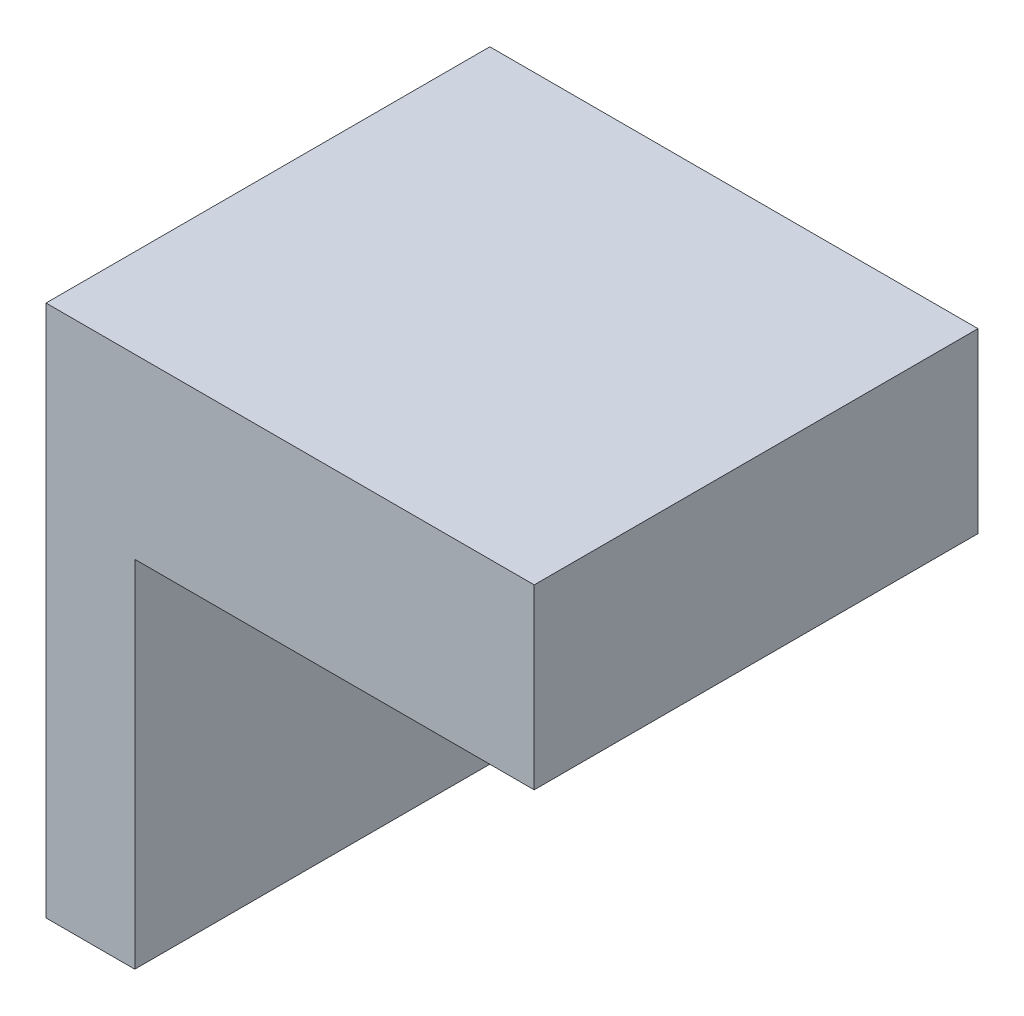
ISO-10303-21;
HEADER;
FILE_DESCRIPTION(('STEP AP214'),'2;1');
FILE_NAME('part.step','',(''),(''),'','','');
FILE_SCHEMA(('AUTOMOTIVE_DESIGN { 1 0 10303 214 1 1 1 1 }'));
ENDSEC;
DATA;
#1=APPLICATION_CONTEXT('core data for automotive mechanical design processes');
#2=APPLICATION_PROTOCOL_DEFINITION('international standard','automotive_design',2000,#1);
#3=PRODUCT_CONTEXT('',#1,'mechanical');
#4=PRODUCT('Part','Part','',(#3));
#5=PRODUCT_RELATED_PRODUCT_CATEGORY('part','',(#4));
#6=PRODUCT_DEFINITION_FORMATION('','',#4);
#7=PRODUCT_DEFINITION_CONTEXT('part definition',#1,'design');
#8=PRODUCT_DEFINITION('design','',#6,#7);
#9=PRODUCT_DEFINITION_SHAPE('','',#8);
#10=(LENGTH_UNIT() NAMED_UNIT(*) SI_UNIT(.MILLI.,.METRE.));
#11=(NAMED_UNIT(*) PLANE_ANGLE_UNIT() SI_UNIT($,.RADIAN.));
#12=(NAMED_UNIT(*) SI_UNIT($,.STERADIAN.) SOLID_ANGLE_UNIT());
#13=UNCERTAINTY_MEASURE_WITH_UNIT(LENGTH_MEASURE(1.E-05),#10,'distance_accuracy_value','');
#14=(GEOMETRIC_REPRESENTATION_CONTEXT(3) GLOBAL_UNCERTAINTY_ASSIGNED_CONTEXT((#13)) GLOBAL_UNIT_ASSIGNED_CONTEXT((#10,
#11,#12)) REPRESENTATION_CONTEXT('',''));
#15=CARTESIAN_POINT('',(0.,0.,0.));
#16=DIRECTION('',(0.,0.,1.));
#17=DIRECTION('',(1.,0.,0.));
#18=AXIS2_PLACEMENT_3D('',#15,#16,#17);
#19=CARTESIAN_POINT('',(-42.3130003902125,-15.1462692619627,50.));
#20=DIRECTION('',(1.,0.,0.));
#21=DIRECTION('',(0.,0.,-1.));
#22=AXIS2_PLACEMENT_3D('',#19,#20,#21);
#23=PLANE('',#22);
#24=CARTESIAN_POINT('',(-42.3130003902125,-55.1462692619627,25.));
#25=DIRECTION('',(1.,0.,0.));
#26=DIRECTION('',(0.,0.,-1.));
#27=AXIS2_PLACEMENT_3D('',#24,#25,#26);
#28=CIRCLE('',#27,2.49999999999999);
#29=CARTESIAN_POINT('',(-42.3130003902125,-55.1462692619627,22.5));
#30=VERTEX_POINT('',#29);
#31=EDGE_CURVE('E121',#30,#30,#28,.T.);
#32=ORIENTED_EDGE('',*,*,#31,.T.);
#33=EDGE_LOOP('',(#32));
#34=FACE_BOUND('',#33,.T.);
#35=DIRECTION('',(0.,-1.,0.));
#36=VECTOR('',#35,1.);
#37=CARTESIAN_POINT('',(-42.3130003902125,-15.1462692619627,0.));
#38=LINE('',#37,#36);
#39=CARTESIAN_POINT('',(-42.3130003902125,-15.1462692619627,0.));
#40=VERTEX_POINT('',#39);
#41=CARTESIAN_POINT('',(-42.3130003902125,-75.1462692619627,0.));
#42=VERTEX_POINT('',#41);
#43=EDGE_CURVE('E117',#40,#42,#38,.T.);
#44=ORIENTED_EDGE('',*,*,#43,.T.);
#45=DIRECTION('',(0.,0.,-1.));
#46=VECTOR('',#45,1.);
#47=CARTESIAN_POINT('',(-42.3130003902125,-75.1462692619627,50.));
#48=LINE('',#47,#46);
#49=CARTESIAN_POINT('',(-42.3130003902125,-75.1462692619627,50.));
#50=VERTEX_POINT('',#49);
#51=EDGE_CURVE('E11',#50,#42,#48,.T.);
#52=ORIENTED_EDGE('',*,*,#51,.F.);
#53=DIRECTION('',(0.,-1.,0.));
#54=VECTOR('',#53,1.);
#55=CARTESIAN_POINT('',(-42.3130003902125,-15.1462692619627,50.));
#56=LINE('',#55,#54);
#57=CARTESIAN_POINT('',(-42.3130003902125,-15.1462692619627,50.));
#58=VERTEX_POINT('',#57);
#59=EDGE_CURVE('E128',#58,#50,#56,.T.);
#60=ORIENTED_EDGE('',*,*,#59,.F.);
#61=DIRECTION('',(0.,0.,-1.));
#62=VECTOR('',#61,1.);
#63=CARTESIAN_POINT('',(-42.3130003902125,-15.1462692619627,50.));
#64=LINE('',#63,#62);
#65=EDGE_CURVE('E113',#58,#40,#64,.T.);
#66=ORIENTED_EDGE('',*,*,#65,.T.);
#67=EDGE_LOOP('',(#44,#52,#60,#66));
#68=FACE_BOUND('',#67,.T.);
#69=ADVANCED_FACE('F33',(#34,#68),#23,.F.);
#70=CARTESIAN_POINT('',(-42.3130003902125,-75.1462692619627,50.));
#71=DIRECTION('',(0.,1.,0.));
#72=DIRECTION('',(0.,0.,1.));
#73=AXIS2_PLACEMENT_3D('',#70,#71,#72);
#74=PLANE('',#73);
#75=DIRECTION('',(1.,0.,0.));
#76=VECTOR('',#75,1.);
#77=CARTESIAN_POINT('',(-42.3130003902125,-75.1462692619627,0.));
#78=LINE('',#77,#76);
#79=CARTESIAN_POINT('',(-32.3130003902125,-75.1462692619627,0.));
#80=VERTEX_POINT('',#79);
#81=EDGE_CURVE('E120',#42,#80,#78,.T.);
#82=ORIENTED_EDGE('',*,*,#81,.T.);
#83=DIRECTION('',(0.,0.,-1.));
#84=VECTOR('',#83,1.);
#85=CARTESIAN_POINT('',(-32.3130003902125,-75.1462692619627,50.));
#86=LINE('',#85,#84);
#87=CARTESIAN_POINT('',(-32.3130003902125,-75.1462692619627,50.));
#88=VERTEX_POINT('',#87);
#89=EDGE_CURVE('E41',#88,#80,#86,.T.);
#90=ORIENTED_EDGE('',*,*,#89,.F.);
#91=DIRECTION('',(1.,0.,0.));
#92=VECTOR('',#91,1.);
#93=CARTESIAN_POINT('',(-42.3130003902125,-75.1462692619627,50.));
#94=LINE('',#93,#92);
#95=EDGE_CURVE('E86',#50,#88,#94,.T.);
#96=ORIENTED_EDGE('',*,*,#95,.F.);
#97=ORIENTED_EDGE('',*,*,#51,.T.);
#98=EDGE_LOOP('',(#82,#90,#96,#97));
#99=FACE_BOUND('',#98,.T.);
#100=ADVANCED_FACE('F152',(#99),#74,.F.);
#101=CARTESIAN_POINT('',(-32.3130003902125,-75.1462692619627,50.));
#102=DIRECTION('',(-1.,0.,0.));
#103=DIRECTION('',(0.,0.,1.));
#104=AXIS2_PLACEMENT_3D('',#101,#102,#103);
#105=PLANE('',#104);
#106=CARTESIAN_POINT('',(-32.3130003902125,-55.1462692619627,25.));
#107=DIRECTION('',(1.,0.,0.));
#108=DIRECTION('',(0.,0.,-1.));
#109=AXIS2_PLACEMENT_3D('',#106,#107,#108);
#110=CIRCLE('',#109,2.49999999999999);
#111=CARTESIAN_POINT('',(-32.3130003902125,-55.1462692619627,22.5));
#112=VERTEX_POINT('',#111);
#113=EDGE_CURVE('E160',#112,#112,#110,.T.);
#114=ORIENTED_EDGE('',*,*,#113,.F.);
#115=EDGE_LOOP('',(#114));
#116=FACE_BOUND('',#115,.T.);
#117=DIRECTION('',(0.,1.,0.));
#118=VECTOR('',#117,1.);
#119=CARTESIAN_POINT('',(-32.3130003902125,-75.1462692619627,0.));
#120=LINE('',#119,#118);
#121=CARTESIAN_POINT('',(-32.3130003902125,-35.1462692619627,0.));
#122=VERTEX_POINT('',#121);
#123=EDGE_CURVE('E123',#80,#122,#120,.T.);
#124=ORIENTED_EDGE('',*,*,#123,.T.);
#125=DIRECTION('',(0.,0.,-1.));
#126=VECTOR('',#125,1.);
#127=CARTESIAN_POINT('',(-32.3130003902125,-35.1462692619627,50.));
#128=LINE('',#127,#126);
#129=CARTESIAN_POINT('',(-32.3130003902125,-35.1462692619627,50.));
#130=VERTEX_POINT('',#129);
#131=EDGE_CURVE('E108',#130,#122,#128,.T.);
#132=ORIENTED_EDGE('',*,*,#131,.F.);
#133=DIRECTION('',(0.,1.,0.));
#134=VECTOR('',#133,1.);
#135=CARTESIAN_POINT('',(-32.3130003902125,-75.1462692619627,50.));
#136=LINE('',#135,#134);
#137=EDGE_CURVE('E99',#88,#130,#136,.T.);
#138=ORIENTED_EDGE('',*,*,#137,.F.);
#139=ORIENTED_EDGE('',*,*,#89,.T.);
#140=EDGE_LOOP('',(#124,#132,#138,#139));
#141=FACE_BOUND('',#140,.T.);
#142=ADVANCED_FACE('F134',(#116,#141),#105,.F.);
#143=CARTESIAN_POINT('',(-32.3130003902125,-35.1462692619627,50.));
#144=DIRECTION('',(0.,1.,0.));
#145=DIRECTION('',(0.,0.,1.));
#146=AXIS2_PLACEMENT_3D('',#143,#144,#145);
#147=PLANE('',#146);
#148=DIRECTION('',(1.,0.,0.));
#149=VECTOR('',#148,1.);
#150=CARTESIAN_POINT('',(-32.3130003902125,-35.1462692619627,0.));
#151=LINE('',#150,#149);
#152=CARTESIAN_POINT('',(12.6869996097875,-35.1462692619627,0.));
#153=VERTEX_POINT('',#152);
#154=EDGE_CURVE('E107',#122,#153,#151,.T.);
#155=ORIENTED_EDGE('',*,*,#154,.T.);
#156=DIRECTION('',(0.,0.,-1.));
#157=VECTOR('',#156,1.);
#158=CARTESIAN_POINT('',(12.6869996097875,-35.1462692619627,50.));
#159=LINE('',#158,#157);
#160=CARTESIAN_POINT('',(12.6869996097875,-35.1462692619627,50.));
#161=VERTEX_POINT('',#160);
#162=EDGE_CURVE('E104',#161,#153,#159,.T.);
#163=ORIENTED_EDGE('',*,*,#162,.F.);
#164=DIRECTION('',(1.,0.,0.));
#165=VECTOR('',#164,1.);
#166=CARTESIAN_POINT('',(-32.3130003902125,-35.1462692619627,50.));
#167=LINE('',#166,#165);
#168=EDGE_CURVE('E93',#130,#161,#167,.T.);
#169=ORIENTED_EDGE('',*,*,#168,.F.);
#170=ORIENTED_EDGE('',*,*,#131,.T.);
#171=EDGE_LOOP('',(#155,#163,#169,#170));
#172=FACE_BOUND('',#171,.T.);
#173=ADVANCED_FACE('F105',(#172),#147,.F.);
#174=CARTESIAN_POINT('',(12.6869996097875,-35.1462692619627,50.));
#175=DIRECTION('',(-1.,0.,0.));
#176=DIRECTION('',(0.,0.,1.));
#177=AXIS2_PLACEMENT_3D('',#174,#175,#176);
#178=PLANE('',#177);
#179=DIRECTION('',(0.,1.,0.));
#180=VECTOR('',#179,1.);
#181=CARTESIAN_POINT('',(12.6869996097875,-35.1462692619627,0.));
#182=LINE('',#181,#180);
#183=CARTESIAN_POINT('',(12.6869996097875,-15.1462692619627,0.));
#184=VERTEX_POINT('',#183);
#185=EDGE_CURVE('E72',#153,#184,#182,.T.);
#186=ORIENTED_EDGE('',*,*,#185,.T.);
#187=DIRECTION('',(0.,0.,-1.));
#188=VECTOR('',#187,1.);
#189=CARTESIAN_POINT('',(12.6869996097875,-15.1462692619627,50.));
#190=LINE('',#189,#188);
#191=CARTESIAN_POINT('',(12.6869996097875,-15.1462692619627,50.));
#192=VERTEX_POINT('',#191);
#193=EDGE_CURVE('E109',#192,#184,#190,.T.);
#194=ORIENTED_EDGE('',*,*,#193,.F.);
#195=DIRECTION('',(0.,1.,0.));
#196=VECTOR('',#195,1.);
#197=CARTESIAN_POINT('',(12.6869996097875,-35.1462692619627,50.));
#198=LINE('',#197,#196);
#199=EDGE_CURVE('E97',#161,#192,#198,.T.);
#200=ORIENTED_EDGE('',*,*,#199,.F.);
#201=ORIENTED_EDGE('',*,*,#162,.T.);
#202=EDGE_LOOP('',(#186,#194,#200,#201));
#203=FACE_BOUND('',#202,.T.);
#204=ADVANCED_FACE('F111',(#203),#178,.F.);
#205=CARTESIAN_POINT('',(-42.3130003902125,-15.1462692619627,50.));
#206=DIRECTION('',(0.,-1.,0.));
#207=DIRECTION('',(0.,0.,-1.));
#208=AXIS2_PLACEMENT_3D('',#205,#206,#207);
#209=PLANE('',#208);
#210=DIRECTION('',(-1.,0.,0.));
#211=VECTOR('',#210,1.);
#212=CARTESIAN_POINT('',(-42.3130003902125,-15.1462692619627,0.));
#213=LINE('',#212,#211);
#214=EDGE_CURVE('E78',#184,#40,#213,.T.);
#215=ORIENTED_EDGE('',*,*,#214,.T.);
#216=ORIENTED_EDGE('',*,*,#65,.F.);
#217=DIRECTION('',(-1.,0.,0.));
#218=VECTOR('',#217,1.);
#219=CARTESIAN_POINT('',(-42.3130003902125,-15.1462692619627,50.));
#220=LINE('',#219,#218);
#221=EDGE_CURVE('E49',#192,#58,#220,.T.);
#222=ORIENTED_EDGE('',*,*,#221,.F.);
#223=ORIENTED_EDGE('',*,*,#193,.T.);
#224=EDGE_LOOP('',(#215,#216,#222,#223));
#225=FACE_BOUND('',#224,.T.);
#226=ADVANCED_FACE('F141',(#225),#209,.F.);
#227=CARTESIAN_POINT('',(0.,0.,50.));
#228=DIRECTION('',(0.,0.,1.));
#229=DIRECTION('',(1.,0.,0.));
#230=AXIS2_PLACEMENT_3D('',#227,#228,#229);
#231=PLANE('',#230);
#232=ORIENTED_EDGE('',*,*,#59,.T.);
#233=ORIENTED_EDGE('',*,*,#95,.T.);
#234=ORIENTED_EDGE('',*,*,#137,.T.);
#235=ORIENTED_EDGE('',*,*,#168,.T.);
#236=ORIENTED_EDGE('',*,*,#199,.T.);
#237=ORIENTED_EDGE('',*,*,#221,.T.);
#238=EDGE_LOOP('',(#232,#233,#234,#235,#236,#237));
#239=FACE_BOUND('',#238,.T.);
#240=ADVANCED_FACE('F95',(#239),#231,.T.);
#241=CARTESIAN_POINT('',(0.,0.,0.));
#242=DIRECTION('',(0.,0.,1.));
#243=DIRECTION('',(1.,0.,0.));
#244=AXIS2_PLACEMENT_3D('',#241,#242,#243);
#245=PLANE('',#244);
#246=ORIENTED_EDGE('',*,*,#43,.F.);
#247=ORIENTED_EDGE('',*,*,#214,.F.);
#248=ORIENTED_EDGE('',*,*,#185,.F.);
#249=ORIENTED_EDGE('',*,*,#154,.F.);
#250=ORIENTED_EDGE('',*,*,#123,.F.);
#251=ORIENTED_EDGE('',*,*,#81,.F.);
#252=EDGE_LOOP('',(#246,#247,#248,#249,#250,#251));
#253=FACE_BOUND('',#252,.T.);
#254=ADVANCED_FACE('F137',(#253),#245,.F.);
#255=CARTESIAN_POINT('',(-32.3130003902125,-55.1462692619627,25.));
#256=DIRECTION('',(1.,0.,0.));
#257=DIRECTION('',(0.,0.,-1.));
#258=AXIS2_PLACEMENT_3D('',#255,#256,#257);
#259=CYLINDRICAL_SURFACE('',#258,2.49999999999999);
#260=ORIENTED_EDGE('',*,*,#113,.T.);
#261=EDGE_LOOP('',(#260));
#262=FACE_BOUND('',#261,.T.);
#263=ORIENTED_EDGE('',*,*,#31,.F.);
#264=EDGE_LOOP('',(#263));
#265=FACE_BOUND('',#264,.T.);
#266=ADVANCED_FACE('F168',(#262,#265),#259,.F.);
#267=CLOSED_SHELL('',(#69,#100,#142,#173,#204,#226,#240,#254,#266));
#268=MANIFOLD_SOLID_BREP('B2',#267);
#269=ADVANCED_BREP_SHAPE_REPRESENTATION('',(#18,#268),#14);
#270=SHAPE_DEFINITION_REPRESENTATION(#9,#269);
ENDSEC;
END-ISO-10303-21;
